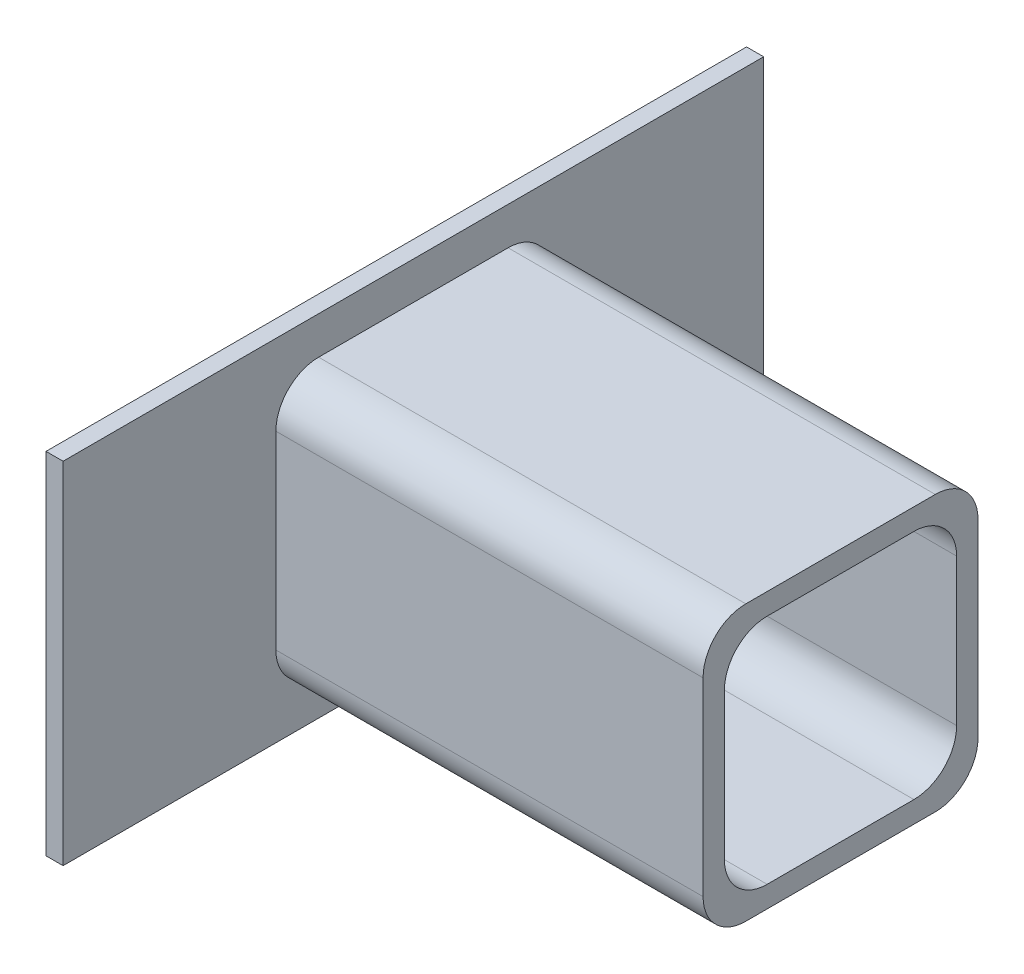
ISO-10303-21;
HEADER;
FILE_DESCRIPTION(('STEP AP214'),'2;1');
FILE_NAME('part.step','',(''),(''),'','','');
FILE_SCHEMA(('AUTOMOTIVE_DESIGN { 1 0 10303 214 1 1 1 1 }'));
ENDSEC;
DATA;
#1=APPLICATION_CONTEXT('core data for automotive mechanical design processes');
#2=APPLICATION_PROTOCOL_DEFINITION('international standard','automotive_design',2000,#1);
#3=PRODUCT_CONTEXT('',#1,'mechanical');
#4=PRODUCT('Part','Part','',(#3));
#5=PRODUCT_RELATED_PRODUCT_CATEGORY('part','',(#4));
#6=PRODUCT_DEFINITION_FORMATION('','',#4);
#7=PRODUCT_DEFINITION_CONTEXT('part definition',#1,'design');
#8=PRODUCT_DEFINITION('design','',#6,#7);
#9=PRODUCT_DEFINITION_SHAPE('','',#8);
#10=(LENGTH_UNIT() NAMED_UNIT(*) SI_UNIT(.MILLI.,.METRE.));
#11=(NAMED_UNIT(*) PLANE_ANGLE_UNIT() SI_UNIT($,.RADIAN.));
#12=(NAMED_UNIT(*) SI_UNIT($,.STERADIAN.) SOLID_ANGLE_UNIT());
#13=UNCERTAINTY_MEASURE_WITH_UNIT(LENGTH_MEASURE(1.E-05),#10,'distance_accuracy_value','');
#14=(GEOMETRIC_REPRESENTATION_CONTEXT(3) GLOBAL_UNCERTAINTY_ASSIGNED_CONTEXT((#13)) GLOBAL_UNIT_ASSIGNED_CONTEXT((#10,
#11,#12)) REPRESENTATION_CONTEXT('',''));
#15=CARTESIAN_POINT('',(0.,0.,0.));
#16=DIRECTION('',(0.,0.,1.));
#17=DIRECTION('',(1.,0.,0.));
#18=AXIS2_PLACEMENT_3D('',#15,#16,#17);
#19=CARTESIAN_POINT('',(4.,0.,0.));
#20=DIRECTION('',(-1.,0.,0.));
#21=DIRECTION('',(0.,0.,1.));
#22=AXIS2_PLACEMENT_3D('',#19,#20,#21);
#23=PLANE('',#22);
#24=DIRECTION('',(0.,1.,0.));
#25=VECTOR('',#24,1.);
#26=CARTESIAN_POINT('',(4.,-41.,-82.));
#27=LINE('',#26,#25);
#28=CARTESIAN_POINT('',(4.,-41.,-82.));
#29=VERTEX_POINT('',#28);
#30=CARTESIAN_POINT('',(4.,41.,-82.));
#31=VERTEX_POINT('',#30);
#32=EDGE_CURVE('E304',#29,#31,#27,.T.);
#33=ORIENTED_EDGE('',*,*,#32,.T.);
#34=DIRECTION('',(0.,0.,1.));
#35=VECTOR('',#34,1.);
#36=CARTESIAN_POINT('',(4.,41.,82.));
#37=LINE('',#36,#35);
#38=CARTESIAN_POINT('',(4.,41.,82.));
#39=VERTEX_POINT('',#38);
#40=EDGE_CURVE('E307',#31,#39,#37,.T.);
#41=ORIENTED_EDGE('',*,*,#40,.T.);
#42=DIRECTION('',(0.,-1.,0.));
#43=VECTOR('',#42,1.);
#44=CARTESIAN_POINT('',(4.,-41.,82.));
#45=LINE('',#44,#43);
#46=CARTESIAN_POINT('',(4.,-41.,82.));
#47=VERTEX_POINT('',#46);
#48=EDGE_CURVE('E310',#39,#47,#45,.T.);
#49=ORIENTED_EDGE('',*,*,#48,.T.);
#50=DIRECTION('',(0.,0.,-1.));
#51=VECTOR('',#50,1.);
#52=CARTESIAN_POINT('',(4.,-41.,82.));
#53=LINE('',#52,#51);
#54=EDGE_CURVE('E312',#47,#29,#53,.T.);
#55=ORIENTED_EDGE('',*,*,#54,.T.);
#56=EDGE_LOOP('',(#33,#41,#49,#55));
#57=FACE_BOUND('',#56,.T.);
#58=CARTESIAN_POINT('',(4.,-22.18,-22.18));
#59=DIRECTION('',(1.,0.,0.));
#60=DIRECTION('',(0.,0.,-1.));
#61=AXIS2_PLACEMENT_3D('',#58,#59,#60);
#62=CIRCLE('',#61,10.);
#63=CARTESIAN_POINT('',(4.,-32.18,-22.1799999999999));
#64=VERTEX_POINT('',#63);
#65=CARTESIAN_POINT('',(4.,-22.1799999999999,-32.18));
#66=VERTEX_POINT('',#65);
#67=EDGE_CURVE('E191',#64,#66,#62,.T.);
#68=ORIENTED_EDGE('',*,*,#67,.F.);
#69=DIRECTION('',(0.,0.,-1.));
#70=VECTOR('',#69,1.);
#71=CARTESIAN_POINT('',(4.,-32.18,22.1799999999999));
#72=LINE('',#71,#70);
#73=CARTESIAN_POINT('',(4.,-32.18,22.1799999999999));
#74=VERTEX_POINT('',#73);
#75=EDGE_CURVE('E248',#74,#64,#72,.T.);
#76=ORIENTED_EDGE('',*,*,#75,.F.);
#77=CARTESIAN_POINT('',(4.,-22.18,22.18));
#78=DIRECTION('',(1.,0.,0.));
#79=DIRECTION('',(0.,0.,1.));
#80=AXIS2_PLACEMENT_3D('',#77,#78,#79);
#81=CIRCLE('',#80,10.);
#82=CARTESIAN_POINT('',(4.,-22.18,32.18));
#83=VERTEX_POINT('',#82);
#84=EDGE_CURVE('E276',#83,#74,#81,.T.);
#85=ORIENTED_EDGE('',*,*,#84,.F.);
#86=DIRECTION('',(0.,-1.,0.));
#87=VECTOR('',#86,1.);
#88=CARTESIAN_POINT('',(4.,-22.1799999999999,32.18));
#89=LINE('',#88,#87);
#90=CARTESIAN_POINT('',(4.,22.1799999999999,32.18));
#91=VERTEX_POINT('',#90);
#92=EDGE_CURVE('E273',#91,#83,#89,.T.);
#93=ORIENTED_EDGE('',*,*,#92,.F.);
#94=CARTESIAN_POINT('',(4.,22.18,22.18));
#95=DIRECTION('',(1.,0.,0.));
#96=DIRECTION('',(0.,0.,1.));
#97=AXIS2_PLACEMENT_3D('',#94,#95,#96);
#98=CIRCLE('',#97,10.);
#99=CARTESIAN_POINT('',(4.,32.18,22.1799999999999));
#100=VERTEX_POINT('',#99);
#101=EDGE_CURVE('E270',#100,#91,#98,.T.);
#102=ORIENTED_EDGE('',*,*,#101,.F.);
#103=DIRECTION('',(0.,0.,1.));
#104=VECTOR('',#103,1.);
#105=CARTESIAN_POINT('',(4.,32.18,22.1799999999999));
#106=LINE('',#105,#104);
#107=CARTESIAN_POINT('',(4.,32.18,-22.1799999999999));
#108=VERTEX_POINT('',#107);
#109=EDGE_CURVE('E267',#108,#100,#106,.T.);
#110=ORIENTED_EDGE('',*,*,#109,.F.);
#111=CARTESIAN_POINT('',(4.,22.18,-22.18));
#112=DIRECTION('',(1.,0.,0.));
#113=DIRECTION('',(0.,0.,1.));
#114=AXIS2_PLACEMENT_3D('',#111,#112,#113);
#115=CIRCLE('',#114,10.);
#116=CARTESIAN_POINT('',(4.,22.1799999999999,-32.18));
#117=VERTEX_POINT('',#116);
#118=EDGE_CURVE('E57',#117,#108,#115,.T.);
#119=ORIENTED_EDGE('',*,*,#118,.F.);
#120=DIRECTION('',(0.,1.,0.));
#121=VECTOR('',#120,1.);
#122=CARTESIAN_POINT('',(4.,-22.1799999999999,-32.18));
#123=LINE('',#122,#121);
#124=EDGE_CURVE('E52',#66,#117,#123,.T.);
#125=ORIENTED_EDGE('',*,*,#124,.F.);
#126=EDGE_LOOP('',(#68,#76,#85,#93,#102,#110,#119,#125));
#127=FACE_BOUND('',#126,.T.);
#128=ADVANCED_FACE('F37',(#57,#127),#23,.F.);
#129=CARTESIAN_POINT('',(4.,-41.,-82.));
#130=DIRECTION('',(0.,0.,1.));
#131=DIRECTION('',(1.,0.,0.));
#132=AXIS2_PLACEMENT_3D('',#129,#130,#131);
#133=PLANE('',#132);
#134=DIRECTION('',(0.,1.,0.));
#135=VECTOR('',#134,1.);
#136=CARTESIAN_POINT('',(0.,-41.,-82.));
#137=LINE('',#136,#135);
#138=CARTESIAN_POINT('',(0.,-41.,-82.));
#139=VERTEX_POINT('',#138);
#140=CARTESIAN_POINT('',(0.,41.,-82.));
#141=VERTEX_POINT('',#140);
#142=EDGE_CURVE('E303',#139,#141,#137,.T.);
#143=ORIENTED_EDGE('',*,*,#142,.T.);
#144=DIRECTION('',(-1.,0.,0.));
#145=VECTOR('',#144,1.);
#146=CARTESIAN_POINT('',(4.,41.,-82.));
#147=LINE('',#146,#145);
#148=EDGE_CURVE('E11',#31,#141,#147,.T.);
#149=ORIENTED_EDGE('',*,*,#148,.F.);
#150=ORIENTED_EDGE('',*,*,#32,.F.);
#151=DIRECTION('',(-1.,0.,0.));
#152=VECTOR('',#151,1.);
#153=CARTESIAN_POINT('',(4.,-41.,-82.));
#154=LINE('',#153,#152);
#155=EDGE_CURVE('E314',#29,#139,#154,.T.);
#156=ORIENTED_EDGE('',*,*,#155,.T.);
#157=EDGE_LOOP('',(#143,#149,#150,#156));
#158=FACE_BOUND('',#157,.T.);
#159=ADVANCED_FACE('F39',(#158),#133,.F.);
#160=CARTESIAN_POINT('',(4.,41.,82.));
#161=DIRECTION('',(0.,-1.,0.));
#162=DIRECTION('',(0.,0.,-1.));
#163=AXIS2_PLACEMENT_3D('',#160,#161,#162);
#164=PLANE('',#163);
#165=DIRECTION('',(0.,0.,1.));
#166=VECTOR('',#165,1.);
#167=CARTESIAN_POINT('',(0.,41.,82.));
#168=LINE('',#167,#166);
#169=CARTESIAN_POINT('',(0.,41.,82.));
#170=VERTEX_POINT('',#169);
#171=EDGE_CURVE('E317',#141,#170,#168,.T.);
#172=ORIENTED_EDGE('',*,*,#171,.T.);
#173=DIRECTION('',(-1.,0.,0.));
#174=VECTOR('',#173,1.);
#175=CARTESIAN_POINT('',(4.,41.,82.));
#176=LINE('',#175,#174);
#177=EDGE_CURVE('E45',#39,#170,#176,.T.);
#178=ORIENTED_EDGE('',*,*,#177,.F.);
#179=ORIENTED_EDGE('',*,*,#40,.F.);
#180=ORIENTED_EDGE('',*,*,#148,.T.);
#181=EDGE_LOOP('',(#172,#178,#179,#180));
#182=FACE_BOUND('',#181,.T.);
#183=ADVANCED_FACE('F346',(#182),#164,.F.);
#184=CARTESIAN_POINT('',(4.,-41.,82.));
#185=DIRECTION('',(0.,0.,-1.));
#186=DIRECTION('',(-1.,0.,0.));
#187=AXIS2_PLACEMENT_3D('',#184,#185,#186);
#188=PLANE('',#187);
#189=DIRECTION('',(0.,-1.,0.));
#190=VECTOR('',#189,1.);
#191=CARTESIAN_POINT('',(0.,-41.,82.));
#192=LINE('',#191,#190);
#193=CARTESIAN_POINT('',(0.,-41.,82.));
#194=VERTEX_POINT('',#193);
#195=EDGE_CURVE('E319',#170,#194,#192,.T.);
#196=ORIENTED_EDGE('',*,*,#195,.T.);
#197=DIRECTION('',(-1.,0.,0.));
#198=VECTOR('',#197,1.);
#199=CARTESIAN_POINT('',(4.,-41.,82.));
#200=LINE('',#199,#198);
#201=EDGE_CURVE('E324',#47,#194,#200,.T.);
#202=ORIENTED_EDGE('',*,*,#201,.F.);
#203=ORIENTED_EDGE('',*,*,#48,.F.);
#204=ORIENTED_EDGE('',*,*,#177,.T.);
#205=EDGE_LOOP('',(#196,#202,#203,#204));
#206=FACE_BOUND('',#205,.T.);
#207=ADVANCED_FACE('F331',(#206),#188,.F.);
#208=CARTESIAN_POINT('',(4.,-41.,82.));
#209=DIRECTION('',(0.,1.,0.));
#210=DIRECTION('',(0.,0.,1.));
#211=AXIS2_PLACEMENT_3D('',#208,#209,#210);
#212=PLANE('',#211);
#213=DIRECTION('',(0.,0.,-1.));
#214=VECTOR('',#213,1.);
#215=CARTESIAN_POINT('',(0.,-41.,82.));
#216=LINE('',#215,#214);
#217=EDGE_CURVE('E308',#194,#139,#216,.T.);
#218=ORIENTED_EDGE('',*,*,#217,.T.);
#219=ORIENTED_EDGE('',*,*,#155,.F.);
#220=ORIENTED_EDGE('',*,*,#54,.F.);
#221=ORIENTED_EDGE('',*,*,#201,.T.);
#222=EDGE_LOOP('',(#218,#219,#220,#221));
#223=FACE_BOUND('',#222,.T.);
#224=ADVANCED_FACE('F340',(#223),#212,.F.);
#225=CARTESIAN_POINT('',(0.,0.,0.));
#226=DIRECTION('',(-1.,0.,0.));
#227=DIRECTION('',(0.,0.,1.));
#228=AXIS2_PLACEMENT_3D('',#225,#226,#227);
#229=PLANE('',#228);
#230=ORIENTED_EDGE('',*,*,#142,.F.);
#231=ORIENTED_EDGE('',*,*,#217,.F.);
#232=ORIENTED_EDGE('',*,*,#195,.F.);
#233=ORIENTED_EDGE('',*,*,#171,.F.);
#234=EDGE_LOOP('',(#230,#231,#232,#233));
#235=FACE_BOUND('',#234,.T.);
#236=ADVANCED_FACE('F337',(#235),#229,.T.);
#237=CARTESIAN_POINT('',(104.,-22.18,-22.18));
#238=DIRECTION('',(1.,0.,0.));
#239=DIRECTION('',(0.,0.,-1.));
#240=AXIS2_PLACEMENT_3D('',#237,#238,#239);
#241=PLANE('',#240);
#242=CARTESIAN_POINT('',(104.,-22.18,-22.18));
#243=DIRECTION('',(1.,0.,0.));
#244=DIRECTION('',(0.,0.,-1.));
#245=AXIS2_PLACEMENT_3D('',#242,#243,#244);
#246=CIRCLE('',#245,10.);
#247=CARTESIAN_POINT('',(104.,-32.18,-22.1799999999999));
#248=VERTEX_POINT('',#247);
#249=CARTESIAN_POINT('',(104.,-22.1799999999999,-32.18));
#250=VERTEX_POINT('',#249);
#251=EDGE_CURVE('E244',#248,#250,#246,.T.);
#252=ORIENTED_EDGE('',*,*,#251,.T.);
#253=DIRECTION('',(0.,1.,0.));
#254=VECTOR('',#253,1.);
#255=CARTESIAN_POINT('',(104.,-22.1799999999999,-32.18));
#256=LINE('',#255,#254);
#257=CARTESIAN_POINT('',(104.,22.1799999999999,-32.18));
#258=VERTEX_POINT('',#257);
#259=EDGE_CURVE('E247',#250,#258,#256,.T.);
#260=ORIENTED_EDGE('',*,*,#259,.T.);
#261=CARTESIAN_POINT('',(104.,22.18,-22.18));
#262=DIRECTION('',(1.,0.,0.));
#263=DIRECTION('',(0.,0.,1.));
#264=AXIS2_PLACEMENT_3D('',#261,#262,#263);
#265=CIRCLE('',#264,10.);
#266=CARTESIAN_POINT('',(104.,32.18,-22.1799999999999));
#267=VERTEX_POINT('',#266);
#268=EDGE_CURVE('E250',#258,#267,#265,.T.);
#269=ORIENTED_EDGE('',*,*,#268,.T.);
#270=DIRECTION('',(0.,0.,1.));
#271=VECTOR('',#270,1.);
#272=CARTESIAN_POINT('',(104.,32.18,22.1799999999999));
#273=LINE('',#272,#271);
#274=CARTESIAN_POINT('',(104.,32.18,22.1799999999999));
#275=VERTEX_POINT('',#274);
#276=EDGE_CURVE('E252',#267,#275,#273,.T.);
#277=ORIENTED_EDGE('',*,*,#276,.T.);
#278=CARTESIAN_POINT('',(104.,22.18,22.18));
#279=DIRECTION('',(1.,0.,0.));
#280=DIRECTION('',(0.,0.,1.));
#281=AXIS2_PLACEMENT_3D('',#278,#279,#280);
#282=CIRCLE('',#281,10.);
#283=CARTESIAN_POINT('',(104.,22.1799999999999,32.18));
#284=VERTEX_POINT('',#283);
#285=EDGE_CURVE('E254',#275,#284,#282,.T.);
#286=ORIENTED_EDGE('',*,*,#285,.T.);
#287=DIRECTION('',(0.,-1.,0.));
#288=VECTOR('',#287,1.);
#289=CARTESIAN_POINT('',(104.,-22.1799999999999,32.18));
#290=LINE('',#289,#288);
#291=CARTESIAN_POINT('',(104.,-22.18,32.18));
#292=VERTEX_POINT('',#291);
#293=EDGE_CURVE('E256',#284,#292,#290,.T.);
#294=ORIENTED_EDGE('',*,*,#293,.T.);
#295=CARTESIAN_POINT('',(104.,-22.18,22.18));
#296=DIRECTION('',(1.,0.,0.));
#297=DIRECTION('',(0.,0.,1.));
#298=AXIS2_PLACEMENT_3D('',#295,#296,#297);
#299=CIRCLE('',#298,10.);
#300=CARTESIAN_POINT('',(104.,-32.18,22.1799999999999));
#301=VERTEX_POINT('',#300);
#302=EDGE_CURVE('E258',#292,#301,#299,.T.);
#303=ORIENTED_EDGE('',*,*,#302,.T.);
#304=DIRECTION('',(0.,0.,-1.));
#305=VECTOR('',#304,1.);
#306=CARTESIAN_POINT('',(104.,-32.18,22.1799999999999));
#307=LINE('',#306,#305);
#308=EDGE_CURVE('E260',#301,#248,#307,.T.);
#309=ORIENTED_EDGE('',*,*,#308,.T.);
#310=EDGE_LOOP('',(#252,#260,#269,#277,#286,#294,#303,#309));
#311=FACE_BOUND('',#310,.T.);
#312=DIRECTION('',(0.,0.,-1.));
#313=VECTOR('',#312,1.);
#314=CARTESIAN_POINT('',(104.,-27.18,17.1799999999999));
#315=LINE('',#314,#313);
#316=CARTESIAN_POINT('',(104.,-27.18,17.1799999999999));
#317=VERTEX_POINT('',#316);
#318=CARTESIAN_POINT('',(104.,-27.18,-17.1799999999999));
#319=VERTEX_POINT('',#318);
#320=EDGE_CURVE('E183',#317,#319,#315,.T.);
#321=ORIENTED_EDGE('',*,*,#320,.F.);
#322=CARTESIAN_POINT('',(104.,-17.18,17.18));
#323=DIRECTION('',(1.,0.,0.));
#324=DIRECTION('',(0.,0.,1.));
#325=AXIS2_PLACEMENT_3D('',#322,#323,#324);
#326=CIRCLE('',#325,10.);
#327=CARTESIAN_POINT('',(104.,-17.1799999999999,27.18));
#328=VERTEX_POINT('',#327);
#329=EDGE_CURVE('E173',#328,#317,#326,.T.);
#330=ORIENTED_EDGE('',*,*,#329,.F.);
#331=DIRECTION('',(0.,-1.,0.));
#332=VECTOR('',#331,1.);
#333=CARTESIAN_POINT('',(104.,-17.1799999999999,27.18));
#334=LINE('',#333,#332);
#335=CARTESIAN_POINT('',(104.,17.1799999999999,27.18));
#336=VERTEX_POINT('',#335);
#337=EDGE_CURVE('E210',#336,#328,#334,.T.);
#338=ORIENTED_EDGE('',*,*,#337,.F.);
#339=CARTESIAN_POINT('',(104.,17.18,17.18));
#340=DIRECTION('',(1.,0.,0.));
#341=DIRECTION('',(0.,0.,1.));
#342=AXIS2_PLACEMENT_3D('',#339,#340,#341);
#343=CIRCLE('',#342,10.);
#344=CARTESIAN_POINT('',(104.,27.18,17.1799999999999));
#345=VERTEX_POINT('',#344);
#346=EDGE_CURVE('E207',#345,#336,#343,.T.);
#347=ORIENTED_EDGE('',*,*,#346,.F.);
#348=DIRECTION('',(0.,0.,1.));
#349=VECTOR('',#348,1.);
#350=CARTESIAN_POINT('',(104.,27.18,17.1799999999999));
#351=LINE('',#350,#349);
#352=CARTESIAN_POINT('',(104.,27.18,-17.1799999999999));
#353=VERTEX_POINT('',#352);
#354=EDGE_CURVE('E205',#353,#345,#351,.T.);
#355=ORIENTED_EDGE('',*,*,#354,.F.);
#356=CARTESIAN_POINT('',(104.,17.18,-17.18));
#357=DIRECTION('',(1.,0.,0.));
#358=DIRECTION('',(0.,0.,1.));
#359=AXIS2_PLACEMENT_3D('',#356,#357,#358);
#360=CIRCLE('',#359,10.);
#361=CARTESIAN_POINT('',(104.,17.1799999999999,-27.18));
#362=VERTEX_POINT('',#361);
#363=EDGE_CURVE('E203',#362,#353,#360,.T.);
#364=ORIENTED_EDGE('',*,*,#363,.F.);
#365=DIRECTION('',(0.,1.,0.));
#366=VECTOR('',#365,1.);
#367=CARTESIAN_POINT('',(104.,-17.1799999999999,-27.18));
#368=LINE('',#367,#366);
#369=CARTESIAN_POINT('',(104.,-17.18,-27.18));
#370=VERTEX_POINT('',#369);
#371=EDGE_CURVE('E199',#370,#362,#368,.T.);
#372=ORIENTED_EDGE('',*,*,#371,.F.);
#373=CARTESIAN_POINT('',(104.,-17.18,-17.18));
#374=DIRECTION('',(1.,0.,0.));
#375=DIRECTION('',(0.,0.,-1.));
#376=AXIS2_PLACEMENT_3D('',#373,#374,#375);
#377=CIRCLE('',#376,10.);
#378=EDGE_CURVE('E197',#319,#370,#377,.T.);
#379=ORIENTED_EDGE('',*,*,#378,.F.);
#380=EDGE_LOOP('',(#321,#330,#338,#347,#355,#364,#372,#379));
#381=FACE_BOUND('',#380,.T.);
#382=ADVANCED_FACE('F195',(#311,#381),#241,.T.);
#383=CARTESIAN_POINT('',(104.,-22.18,-22.18));
#384=DIRECTION('',(-1.,0.,0.));
#385=DIRECTION('',(0.,0.,1.));
#386=AXIS2_PLACEMENT_3D('',#383,#384,#385);
#387=CYLINDRICAL_SURFACE('',#386,10.);
#388=ORIENTED_EDGE('',*,*,#67,.T.);
#389=DIRECTION('',(-1.,0.,0.));
#390=VECTOR('',#389,1.);
#391=CARTESIAN_POINT('',(104.,-22.1799999999999,-32.18));
#392=LINE('',#391,#390);
#393=EDGE_CURVE('E301',#250,#66,#392,.T.);
#394=ORIENTED_EDGE('',*,*,#393,.F.);
#395=ORIENTED_EDGE('',*,*,#251,.F.);
#396=DIRECTION('',(-1.,0.,0.));
#397=VECTOR('',#396,1.);
#398=CARTESIAN_POINT('',(104.,-32.18,-22.1799999999999));
#399=LINE('',#398,#397);
#400=EDGE_CURVE('E262',#248,#64,#399,.T.);
#401=ORIENTED_EDGE('',*,*,#400,.T.);
#402=EDGE_LOOP('',(#388,#394,#395,#401));
#403=FACE_BOUND('',#402,.T.);
#404=ADVANCED_FACE('F406',(#403),#387,.T.);
#405=CARTESIAN_POINT('',(104.,-22.1799999999999,-32.18));
#406=DIRECTION('',(0.,0.,1.));
#407=DIRECTION('',(1.,0.,0.));
#408=AXIS2_PLACEMENT_3D('',#405,#406,#407);
#409=PLANE('',#408);
#410=ORIENTED_EDGE('',*,*,#124,.T.);
#411=DIRECTION('',(-1.,0.,0.));
#412=VECTOR('',#411,1.);
#413=CARTESIAN_POINT('',(104.,22.1799999999999,-32.18));
#414=LINE('',#413,#412);
#415=EDGE_CURVE('E298',#258,#117,#414,.T.);
#416=ORIENTED_EDGE('',*,*,#415,.F.);
#417=ORIENTED_EDGE('',*,*,#259,.F.);
#418=ORIENTED_EDGE('',*,*,#393,.T.);
#419=EDGE_LOOP('',(#410,#416,#417,#418));
#420=FACE_BOUND('',#419,.T.);
#421=ADVANCED_FACE('F430',(#420),#409,.F.);
#422=CARTESIAN_POINT('',(104.,22.18,-22.18));
#423=DIRECTION('',(-1.,0.,0.));
#424=DIRECTION('',(0.,0.,1.));
#425=AXIS2_PLACEMENT_3D('',#422,#423,#424);
#426=CYLINDRICAL_SURFACE('',#425,10.);
#427=ORIENTED_EDGE('',*,*,#118,.T.);
#428=DIRECTION('',(-1.,0.,0.));
#429=VECTOR('',#428,1.);
#430=CARTESIAN_POINT('',(104.,32.18,-22.1799999999999));
#431=LINE('',#430,#429);
#432=EDGE_CURVE('E295',#267,#108,#431,.T.);
#433=ORIENTED_EDGE('',*,*,#432,.F.);
#434=ORIENTED_EDGE('',*,*,#268,.F.);
#435=ORIENTED_EDGE('',*,*,#415,.T.);
#436=EDGE_LOOP('',(#427,#433,#434,#435));
#437=FACE_BOUND('',#436,.T.);
#438=ADVANCED_FACE('F426',(#437),#426,.T.);
#439=CARTESIAN_POINT('',(104.,32.18,22.1799999999999));
#440=DIRECTION('',(0.,-1.,0.));
#441=DIRECTION('',(0.,0.,-1.));
#442=AXIS2_PLACEMENT_3D('',#439,#440,#441);
#443=PLANE('',#442);
#444=ORIENTED_EDGE('',*,*,#109,.T.);
#445=DIRECTION('',(-1.,0.,0.));
#446=VECTOR('',#445,1.);
#447=CARTESIAN_POINT('',(104.,32.18,22.1799999999999));
#448=LINE('',#447,#446);
#449=EDGE_CURVE('E292',#275,#100,#448,.T.);
#450=ORIENTED_EDGE('',*,*,#449,.F.);
#451=ORIENTED_EDGE('',*,*,#276,.F.);
#452=ORIENTED_EDGE('',*,*,#432,.T.);
#453=EDGE_LOOP('',(#444,#450,#451,#452));
#454=FACE_BOUND('',#453,.T.);
#455=ADVANCED_FACE('F422',(#454),#443,.F.);
#456=CARTESIAN_POINT('',(104.,22.18,22.18));
#457=DIRECTION('',(-1.,0.,0.));
#458=DIRECTION('',(0.,0.,1.));
#459=AXIS2_PLACEMENT_3D('',#456,#457,#458);
#460=CYLINDRICAL_SURFACE('',#459,10.);
#461=ORIENTED_EDGE('',*,*,#101,.T.);
#462=DIRECTION('',(-1.,0.,0.));
#463=VECTOR('',#462,1.);
#464=CARTESIAN_POINT('',(104.,22.1799999999999,32.18));
#465=LINE('',#464,#463);
#466=EDGE_CURVE('E289',#284,#91,#465,.T.);
#467=ORIENTED_EDGE('',*,*,#466,.F.);
#468=ORIENTED_EDGE('',*,*,#285,.F.);
#469=ORIENTED_EDGE('',*,*,#449,.T.);
#470=EDGE_LOOP('',(#461,#467,#468,#469));
#471=FACE_BOUND('',#470,.T.);
#472=ADVANCED_FACE('F418',(#471),#460,.T.);
#473=CARTESIAN_POINT('',(104.,-22.1799999999999,32.18));
#474=DIRECTION('',(0.,0.,-1.));
#475=DIRECTION('',(-1.,0.,0.));
#476=AXIS2_PLACEMENT_3D('',#473,#474,#475);
#477=PLANE('',#476);
#478=ORIENTED_EDGE('',*,*,#92,.T.);
#479=DIRECTION('',(-1.,0.,0.));
#480=VECTOR('',#479,1.);
#481=CARTESIAN_POINT('',(104.,-22.18,32.18));
#482=LINE('',#481,#480);
#483=EDGE_CURVE('E286',#292,#83,#482,.T.);
#484=ORIENTED_EDGE('',*,*,#483,.F.);
#485=ORIENTED_EDGE('',*,*,#293,.F.);
#486=ORIENTED_EDGE('',*,*,#466,.T.);
#487=EDGE_LOOP('',(#478,#484,#485,#486));
#488=FACE_BOUND('',#487,.T.);
#489=ADVANCED_FACE('F414',(#488),#477,.F.);
#490=CARTESIAN_POINT('',(104.,-22.18,22.18));
#491=DIRECTION('',(-1.,0.,0.));
#492=DIRECTION('',(0.,0.,1.));
#493=AXIS2_PLACEMENT_3D('',#490,#491,#492);
#494=CYLINDRICAL_SURFACE('',#493,10.);
#495=ORIENTED_EDGE('',*,*,#84,.T.);
#496=DIRECTION('',(-1.,0.,0.));
#497=VECTOR('',#496,1.);
#498=CARTESIAN_POINT('',(104.,-32.18,22.1799999999999));
#499=LINE('',#498,#497);
#500=EDGE_CURVE('E283',#301,#74,#499,.T.);
#501=ORIENTED_EDGE('',*,*,#500,.F.);
#502=ORIENTED_EDGE('',*,*,#302,.F.);
#503=ORIENTED_EDGE('',*,*,#483,.T.);
#504=EDGE_LOOP('',(#495,#501,#502,#503));
#505=FACE_BOUND('',#504,.T.);
#506=ADVANCED_FACE('F410',(#505),#494,.T.);
#507=CARTESIAN_POINT('',(104.,-32.18,22.1799999999999));
#508=DIRECTION('',(0.,1.,0.));
#509=DIRECTION('',(0.,0.,1.));
#510=AXIS2_PLACEMENT_3D('',#507,#508,#509);
#511=PLANE('',#510);
#512=ORIENTED_EDGE('',*,*,#75,.T.);
#513=ORIENTED_EDGE('',*,*,#400,.F.);
#514=ORIENTED_EDGE('',*,*,#308,.F.);
#515=ORIENTED_EDGE('',*,*,#500,.T.);
#516=EDGE_LOOP('',(#512,#513,#514,#515));
#517=FACE_BOUND('',#516,.T.);
#518=ADVANCED_FACE('F403',(#517),#511,.F.);
#519=CARTESIAN_POINT('',(104.,-17.18,17.18));
#520=DIRECTION('',(-1.,0.,0.));
#521=DIRECTION('',(0.,0.,1.));
#522=AXIS2_PLACEMENT_3D('',#519,#520,#521);
#523=CYLINDRICAL_SURFACE('',#522,10.);
#524=CARTESIAN_POINT('',(4.,-17.18,17.18));
#525=DIRECTION('',(1.,0.,0.));
#526=DIRECTION('',(0.,0.,1.));
#527=AXIS2_PLACEMENT_3D('',#524,#525,#526);
#528=CIRCLE('',#527,10.);
#529=CARTESIAN_POINT('',(4.,-17.1799999999999,27.18));
#530=VERTEX_POINT('',#529);
#531=CARTESIAN_POINT('',(4.,-27.18,17.1799999999999));
#532=VERTEX_POINT('',#531);
#533=EDGE_CURVE('E212',#530,#532,#528,.T.);
#534=ORIENTED_EDGE('',*,*,#533,.F.);
#535=DIRECTION('',(-1.,0.,0.));
#536=VECTOR('',#535,1.);
#537=CARTESIAN_POINT('',(104.,-17.1799999999999,27.18));
#538=LINE('',#537,#536);
#539=EDGE_CURVE('E179',#328,#530,#538,.T.);
#540=ORIENTED_EDGE('',*,*,#539,.F.);
#541=ORIENTED_EDGE('',*,*,#329,.T.);
#542=DIRECTION('',(-1.,0.,0.));
#543=VECTOR('',#542,1.);
#544=CARTESIAN_POINT('',(104.,-27.18,17.1799999999999));
#545=LINE('',#544,#543);
#546=EDGE_CURVE('E177',#317,#532,#545,.T.);
#547=ORIENTED_EDGE('',*,*,#546,.T.);
#548=EDGE_LOOP('',(#534,#540,#541,#547));
#549=FACE_BOUND('',#548,.T.);
#550=ADVANCED_FACE('F176',(#549),#523,.F.);
#551=CARTESIAN_POINT('',(104.,-27.18,17.1799999999999));
#552=DIRECTION('',(0.,1.,0.));
#553=DIRECTION('',(0.,0.,1.));
#554=AXIS2_PLACEMENT_3D('',#551,#552,#553);
#555=PLANE('',#554);
#556=DIRECTION('',(0.,0.,-1.));
#557=VECTOR('',#556,1.);
#558=CARTESIAN_POINT('',(4.,-27.18,17.1799999999999));
#559=LINE('',#558,#557);
#560=CARTESIAN_POINT('',(4.,-27.18,-17.1799999999999));
#561=VERTEX_POINT('',#560);
#562=EDGE_CURVE('E190',#532,#561,#559,.T.);
#563=ORIENTED_EDGE('',*,*,#562,.F.);
#564=ORIENTED_EDGE('',*,*,#546,.F.);
#565=ORIENTED_EDGE('',*,*,#320,.T.);
#566=DIRECTION('',(-1.,0.,0.));
#567=VECTOR('',#566,1.);
#568=CARTESIAN_POINT('',(104.,-27.18,-17.1799999999999));
#569=LINE('',#568,#567);
#570=EDGE_CURVE('E192',#319,#561,#569,.T.);
#571=ORIENTED_EDGE('',*,*,#570,.T.);
#572=EDGE_LOOP('',(#563,#564,#565,#571));
#573=FACE_BOUND('',#572,.T.);
#574=ADVANCED_FACE('F187',(#573),#555,.T.);
#575=CARTESIAN_POINT('',(104.,-17.18,-17.18));
#576=DIRECTION('',(-1.,0.,0.));
#577=DIRECTION('',(0.,0.,1.));
#578=AXIS2_PLACEMENT_3D('',#575,#576,#577);
#579=CYLINDRICAL_SURFACE('',#578,10.);
#580=CARTESIAN_POINT('',(4.,-17.18,-17.18));
#581=DIRECTION('',(1.,0.,0.));
#582=DIRECTION('',(0.,0.,-1.));
#583=AXIS2_PLACEMENT_3D('',#580,#581,#582);
#584=CIRCLE('',#583,10.);
#585=CARTESIAN_POINT('',(4.,-17.18,-27.18));
#586=VERTEX_POINT('',#585);
#587=EDGE_CURVE('E215',#561,#586,#584,.T.);
#588=ORIENTED_EDGE('',*,*,#587,.F.);
#589=ORIENTED_EDGE('',*,*,#570,.F.);
#590=ORIENTED_EDGE('',*,*,#378,.T.);
#591=DIRECTION('',(-1.,0.,0.));
#592=VECTOR('',#591,1.);
#593=CARTESIAN_POINT('',(104.,-17.18,-27.18));
#594=LINE('',#593,#592);
#595=EDGE_CURVE('E241',#370,#586,#594,.T.);
#596=ORIENTED_EDGE('',*,*,#595,.T.);
#597=EDGE_LOOP('',(#588,#589,#590,#596));
#598=FACE_BOUND('',#597,.T.);
#599=ADVANCED_FACE('F390',(#598),#579,.F.);
#600=CARTESIAN_POINT('',(104.,-17.1799999999999,-27.18));
#601=DIRECTION('',(0.,0.,1.));
#602=DIRECTION('',(1.,0.,0.));
#603=AXIS2_PLACEMENT_3D('',#600,#601,#602);
#604=PLANE('',#603);
#605=DIRECTION('',(0.,1.,0.));
#606=VECTOR('',#605,1.);
#607=CARTESIAN_POINT('',(4.,-17.1799999999999,-27.18));
#608=LINE('',#607,#606);
#609=CARTESIAN_POINT('',(4.,17.1799999999999,-27.18));
#610=VERTEX_POINT('',#609);
#611=EDGE_CURVE('E218',#586,#610,#608,.T.);
#612=ORIENTED_EDGE('',*,*,#611,.F.);
#613=ORIENTED_EDGE('',*,*,#595,.F.);
#614=ORIENTED_EDGE('',*,*,#371,.T.);
#615=DIRECTION('',(-1.,0.,0.));
#616=VECTOR('',#615,1.);
#617=CARTESIAN_POINT('',(104.,17.1799999999999,-27.18));
#618=LINE('',#617,#616);
#619=EDGE_CURVE('E239',#362,#610,#618,.T.);
#620=ORIENTED_EDGE('',*,*,#619,.T.);
#621=EDGE_LOOP('',(#612,#613,#614,#620));
#622=FACE_BOUND('',#621,.T.);
#623=ADVANCED_FACE('F387',(#622),#604,.T.);
#624=CARTESIAN_POINT('',(104.,17.18,-17.18));
#625=DIRECTION('',(-1.,0.,0.));
#626=DIRECTION('',(0.,0.,1.));
#627=AXIS2_PLACEMENT_3D('',#624,#625,#626);
#628=CYLINDRICAL_SURFACE('',#627,10.);
#629=CARTESIAN_POINT('',(4.,17.18,-17.18));
#630=DIRECTION('',(1.,0.,0.));
#631=DIRECTION('',(0.,0.,1.));
#632=AXIS2_PLACEMENT_3D('',#629,#630,#631);
#633=CIRCLE('',#632,10.);
#634=CARTESIAN_POINT('',(4.,27.18,-17.1799999999999));
#635=VERTEX_POINT('',#634);
#636=EDGE_CURVE('E221',#610,#635,#633,.T.);
#637=ORIENTED_EDGE('',*,*,#636,.F.);
#638=ORIENTED_EDGE('',*,*,#619,.F.);
#639=ORIENTED_EDGE('',*,*,#363,.T.);
#640=DIRECTION('',(-1.,0.,0.));
#641=VECTOR('',#640,1.);
#642=CARTESIAN_POINT('',(104.,27.18,-17.1799999999999));
#643=LINE('',#642,#641);
#644=EDGE_CURVE('E237',#353,#635,#643,.T.);
#645=ORIENTED_EDGE('',*,*,#644,.T.);
#646=EDGE_LOOP('',(#637,#638,#639,#645));
#647=FACE_BOUND('',#646,.T.);
#648=ADVANCED_FACE('F382',(#647),#628,.F.);
#649=CARTESIAN_POINT('',(104.,27.18,17.1799999999999));
#650=DIRECTION('',(0.,-1.,0.));
#651=DIRECTION('',(0.,0.,-1.));
#652=AXIS2_PLACEMENT_3D('',#649,#650,#651);
#653=PLANE('',#652);
#654=DIRECTION('',(0.,0.,1.));
#655=VECTOR('',#654,1.);
#656=CARTESIAN_POINT('',(4.,27.18,17.1799999999999));
#657=LINE('',#656,#655);
#658=CARTESIAN_POINT('',(4.,27.18,17.1799999999999));
#659=VERTEX_POINT('',#658);
#660=EDGE_CURVE('E224',#635,#659,#657,.T.);
#661=ORIENTED_EDGE('',*,*,#660,.F.);
#662=ORIENTED_EDGE('',*,*,#644,.F.);
#663=ORIENTED_EDGE('',*,*,#354,.T.);
#664=DIRECTION('',(-1.,0.,0.));
#665=VECTOR('',#664,1.);
#666=CARTESIAN_POINT('',(104.,27.18,17.1799999999999));
#667=LINE('',#666,#665);
#668=EDGE_CURVE('E235',#345,#659,#667,.T.);
#669=ORIENTED_EDGE('',*,*,#668,.T.);
#670=EDGE_LOOP('',(#661,#662,#663,#669));
#671=FACE_BOUND('',#670,.T.);
#672=ADVANCED_FACE('F378',(#671),#653,.T.);
#673=CARTESIAN_POINT('',(104.,17.18,17.18));
#674=DIRECTION('',(-1.,0.,0.));
#675=DIRECTION('',(0.,0.,1.));
#676=AXIS2_PLACEMENT_3D('',#673,#674,#675);
#677=CYLINDRICAL_SURFACE('',#676,10.);
#678=CARTESIAN_POINT('',(4.,17.18,17.18));
#679=DIRECTION('',(1.,0.,0.));
#680=DIRECTION('',(0.,0.,1.));
#681=AXIS2_PLACEMENT_3D('',#678,#679,#680);
#682=CIRCLE('',#681,10.);
#683=CARTESIAN_POINT('',(4.,17.1799999999999,27.18));
#684=VERTEX_POINT('',#683);
#685=EDGE_CURVE('E227',#659,#684,#682,.T.);
#686=ORIENTED_EDGE('',*,*,#685,.F.);
#687=ORIENTED_EDGE('',*,*,#668,.F.);
#688=ORIENTED_EDGE('',*,*,#346,.T.);
#689=DIRECTION('',(-1.,0.,0.));
#690=VECTOR('',#689,1.);
#691=CARTESIAN_POINT('',(104.,17.1799999999999,27.18));
#692=LINE('',#691,#690);
#693=EDGE_CURVE('E233',#336,#684,#692,.T.);
#694=ORIENTED_EDGE('',*,*,#693,.T.);
#695=EDGE_LOOP('',(#686,#687,#688,#694));
#696=FACE_BOUND('',#695,.T.);
#697=ADVANCED_FACE('F366',(#696),#677,.F.);
#698=CARTESIAN_POINT('',(104.,-17.1799999999999,27.18));
#699=DIRECTION('',(0.,0.,-1.));
#700=DIRECTION('',(-1.,0.,0.));
#701=AXIS2_PLACEMENT_3D('',#698,#699,#700);
#702=PLANE('',#701);
#703=DIRECTION('',(0.,-1.,0.));
#704=VECTOR('',#703,1.);
#705=CARTESIAN_POINT('',(4.,-17.1799999999999,27.18));
#706=LINE('',#705,#704);
#707=EDGE_CURVE('E184',#684,#530,#706,.T.);
#708=ORIENTED_EDGE('',*,*,#707,.F.);
#709=ORIENTED_EDGE('',*,*,#693,.F.);
#710=ORIENTED_EDGE('',*,*,#337,.T.);
#711=ORIENTED_EDGE('',*,*,#539,.T.);
#712=EDGE_LOOP('',(#708,#709,#710,#711));
#713=FACE_BOUND('',#712,.T.);
#714=ADVANCED_FACE('F361',(#713),#702,.T.);
#715=ORIENTED_EDGE('',*,*,#707,.T.);
#716=ORIENTED_EDGE('',*,*,#533,.T.);
#717=ORIENTED_EDGE('',*,*,#562,.T.);
#718=ORIENTED_EDGE('',*,*,#587,.T.);
#719=ORIENTED_EDGE('',*,*,#611,.T.);
#720=ORIENTED_EDGE('',*,*,#636,.T.);
#721=ORIENTED_EDGE('',*,*,#660,.T.);
#722=ORIENTED_EDGE('',*,*,#685,.T.);
#723=EDGE_LOOP('',(#715,#716,#717,#718,#719,#720,#721,#722));
#724=FACE_BOUND('',#723,.T.);
#725=ADVANCED_FACE('F355',(#724),#23,.F.);
#726=CLOSED_SHELL('',(#128,#159,#183,#207,#224,#236,#382,#404,#421,#438,#455,#472,#489,#506,
#518,#550,#574,#599,#623,#648,#672,#697,#714,#725));
#727=MANIFOLD_SOLID_BREP('B2',#726);
#728=ADVANCED_BREP_SHAPE_REPRESENTATION('',(#18,#727),#14);
#729=SHAPE_DEFINITION_REPRESENTATION(#9,#728);
ENDSEC;
END-ISO-10303-21;
